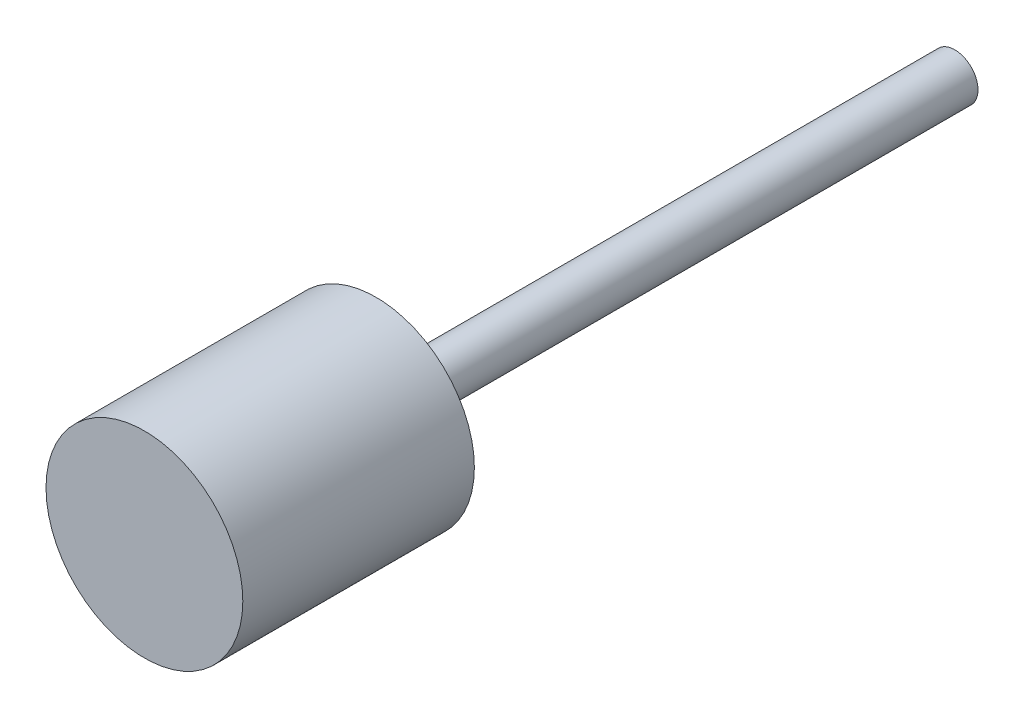
ISO-10303-21;
HEADER;
FILE_DESCRIPTION(('STEP AP214'),'2;1');
FILE_NAME('part.step','',(''),(''),'','','');
FILE_SCHEMA(('AUTOMOTIVE_DESIGN { 1 0 10303 214 1 1 1 1 }'));
ENDSEC;
DATA;
#1=APPLICATION_CONTEXT('core data for automotive mechanical design processes');
#2=APPLICATION_PROTOCOL_DEFINITION('international standard','automotive_design',2000,#1);
#3=PRODUCT_CONTEXT('',#1,'mechanical');
#4=PRODUCT('Part','Part','',(#3));
#5=PRODUCT_RELATED_PRODUCT_CATEGORY('part','',(#4));
#6=PRODUCT_DEFINITION_FORMATION('','',#4);
#7=PRODUCT_DEFINITION_CONTEXT('part definition',#1,'design');
#8=PRODUCT_DEFINITION('design','',#6,#7);
#9=PRODUCT_DEFINITION_SHAPE('','',#8);
#10=(LENGTH_UNIT() NAMED_UNIT(*) SI_UNIT(.MILLI.,.METRE.));
#11=(NAMED_UNIT(*) PLANE_ANGLE_UNIT() SI_UNIT($,.RADIAN.));
#12=(NAMED_UNIT(*) SI_UNIT($,.STERADIAN.) SOLID_ANGLE_UNIT());
#13=UNCERTAINTY_MEASURE_WITH_UNIT(LENGTH_MEASURE(1.E-05),#10,'distance_accuracy_value','');
#14=(GEOMETRIC_REPRESENTATION_CONTEXT(3) GLOBAL_UNCERTAINTY_ASSIGNED_CONTEXT((#13)) GLOBAL_UNIT_ASSIGNED_CONTEXT((#10,
#11,#12)) REPRESENTATION_CONTEXT('',''));
#15=CARTESIAN_POINT('',(0.,0.,0.));
#16=DIRECTION('',(0.,0.,1.));
#17=DIRECTION('',(1.,0.,0.));
#18=AXIS2_PLACEMENT_3D('',#15,#16,#17);
#19=CARTESIAN_POINT('',(0.,0.,50.));
#20=DIRECTION('',(0.,0.,-1.));
#21=DIRECTION('',(-1.,0.,0.));
#22=AXIS2_PLACEMENT_3D('',#19,#20,#21);
#23=CYLINDRICAL_SURFACE('',#22,2.);
#24=CARTESIAN_POINT('',(0.,0.,50.));
#25=DIRECTION('',(0.,0.,1.));
#26=DIRECTION('',(1.,0.,0.));
#27=AXIS2_PLACEMENT_3D('',#24,#25,#26);
#28=CIRCLE('',#27,2.);
#29=CARTESIAN_POINT('',(2.,0.,50.));
#30=VERTEX_POINT('',#29);
#31=EDGE_CURVE('E10',#30,#30,#28,.T.);
#32=ORIENTED_EDGE('',*,*,#31,.F.);
#33=EDGE_LOOP('',(#32));
#34=FACE_BOUND('',#33,.T.);
#35=CARTESIAN_POINT('',(0.,0.,0.));
#36=DIRECTION('',(0.,0.,1.));
#37=DIRECTION('',(1.,0.,0.));
#38=AXIS2_PLACEMENT_3D('',#35,#36,#37);
#39=CIRCLE('',#38,2.);
#40=CARTESIAN_POINT('',(2.,0.,0.));
#41=VERTEX_POINT('',#40);
#42=EDGE_CURVE('E34',#41,#41,#39,.T.);
#43=ORIENTED_EDGE('',*,*,#42,.T.);
#44=EDGE_LOOP('',(#43));
#45=FACE_BOUND('',#44,.T.);
#46=ADVANCED_FACE('F31',(#34,#45),#23,.T.);
#47=CARTESIAN_POINT('',(0.,0.,0.));
#48=DIRECTION('',(0.,0.,1.));
#49=DIRECTION('',(1.,0.,0.));
#50=AXIS2_PLACEMENT_3D('',#47,#48,#49);
#51=PLANE('',#50);
#52=ORIENTED_EDGE('',*,*,#42,.F.);
#53=EDGE_LOOP('',(#52));
#54=FACE_BOUND('',#53,.T.);
#55=ADVANCED_FACE('F54',(#54),#51,.F.);
#56=CARTESIAN_POINT('',(0.,0.,70.));
#57=DIRECTION('',(0.,0.,-1.));
#58=DIRECTION('',(-1.,0.,0.));
#59=AXIS2_PLACEMENT_3D('',#56,#57,#58);
#60=CYLINDRICAL_SURFACE('',#59,8.5);
#61=CARTESIAN_POINT('',(0.,0.,70.));
#62=DIRECTION('',(0.,0.,1.));
#63=DIRECTION('',(1.,0.,0.));
#64=AXIS2_PLACEMENT_3D('',#61,#62,#63);
#65=CIRCLE('',#64,8.5);
#66=CARTESIAN_POINT('',(8.5,0.,70.));
#67=VERTEX_POINT('',#66);
#68=EDGE_CURVE('E41',#67,#67,#65,.T.);
#69=ORIENTED_EDGE('',*,*,#68,.F.);
#70=EDGE_LOOP('',(#69));
#71=FACE_BOUND('',#70,.T.);
#72=CARTESIAN_POINT('',(0.,0.,50.));
#73=DIRECTION('',(0.,0.,1.));
#74=DIRECTION('',(1.,0.,0.));
#75=AXIS2_PLACEMENT_3D('',#72,#73,#74);
#76=CIRCLE('',#75,8.5);
#77=CARTESIAN_POINT('',(8.5,0.,50.));
#78=VERTEX_POINT('',#77);
#79=EDGE_CURVE('E43',#78,#78,#76,.T.);
#80=ORIENTED_EDGE('',*,*,#79,.T.);
#81=EDGE_LOOP('',(#80));
#82=FACE_BOUND('',#81,.T.);
#83=ADVANCED_FACE('F51',(#71,#82),#60,.T.);
#84=CARTESIAN_POINT('',(0.,0.,70.));
#85=DIRECTION('',(0.,0.,1.));
#86=DIRECTION('',(1.,0.,0.));
#87=AXIS2_PLACEMENT_3D('',#84,#85,#86);
#88=PLANE('',#87);
#89=ORIENTED_EDGE('',*,*,#68,.T.);
#90=EDGE_LOOP('',(#89));
#91=FACE_BOUND('',#90,.T.);
#92=ADVANCED_FACE('F49',(#91),#88,.T.);
#93=CARTESIAN_POINT('',(0.,0.,50.));
#94=DIRECTION('',(0.,0.,1.));
#95=DIRECTION('',(1.,0.,0.));
#96=AXIS2_PLACEMENT_3D('',#93,#94,#95);
#97=PLANE('',#96);
#98=ORIENTED_EDGE('',*,*,#31,.T.);
#99=EDGE_LOOP('',(#98));
#100=FACE_BOUND('',#99,.T.);
#101=ORIENTED_EDGE('',*,*,#79,.F.);
#102=EDGE_LOOP('',(#101));
#103=FACE_BOUND('',#102,.T.);
#104=ADVANCED_FACE('F58',(#100,#103),#97,.F.);
#105=CLOSED_SHELL('',(#46,#55,#83,#92,#104));
#106=MANIFOLD_SOLID_BREP('B2',#105);
#107=ADVANCED_BREP_SHAPE_REPRESENTATION('',(#18,#106),#14);
#108=SHAPE_DEFINITION_REPRESENTATION(#9,#107);
ENDSEC;
END-ISO-10303-21;
